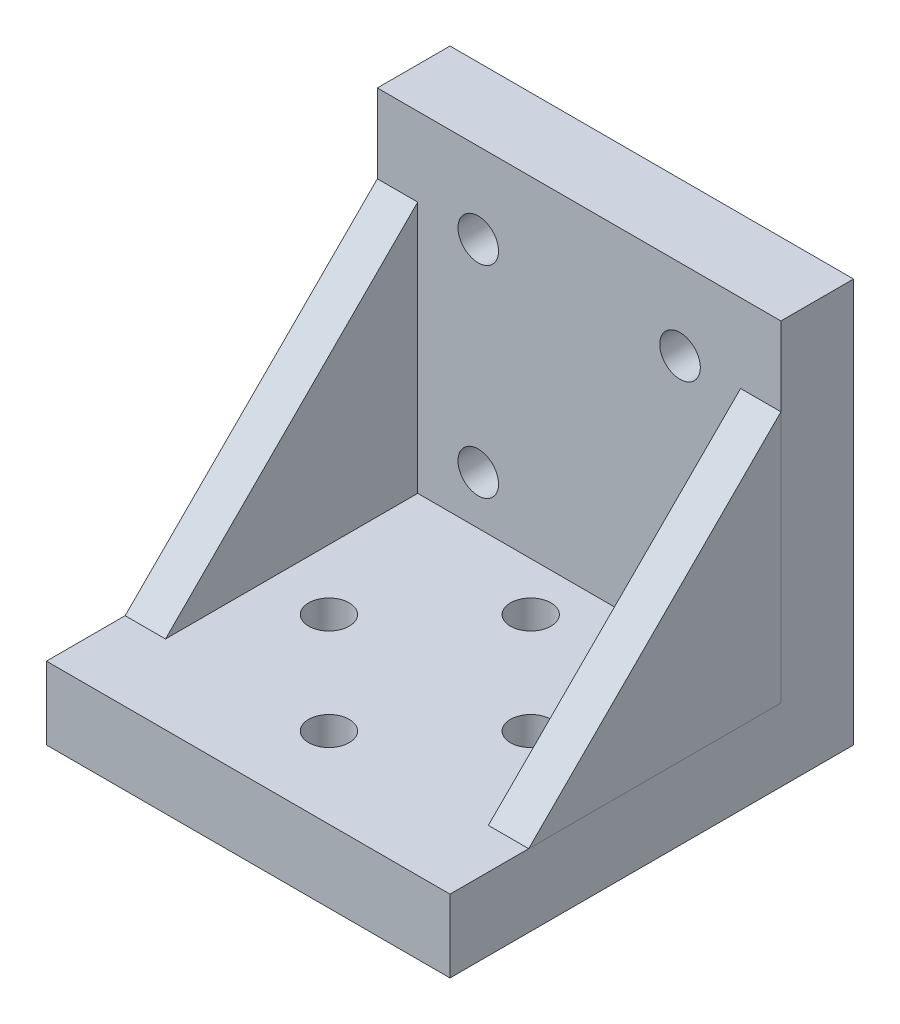
ISO-10303-21;
HEADER;
FILE_DESCRIPTION(('STEP AP214'),'2;1');
FILE_NAME('part.step','',(''),(''),'','','');
FILE_SCHEMA(('AUTOMOTIVE_DESIGN { 1 0 10303 214 1 1 1 1 }'));
ENDSEC;
DATA;
#1=APPLICATION_CONTEXT('core data for automotive mechanical design processes');
#2=APPLICATION_PROTOCOL_DEFINITION('international standard','automotive_design',2000,#1);
#3=PRODUCT_CONTEXT('',#1,'mechanical');
#4=PRODUCT('Part','Part','',(#3));
#5=PRODUCT_RELATED_PRODUCT_CATEGORY('part','',(#4));
#6=PRODUCT_DEFINITION_FORMATION('','',#4);
#7=PRODUCT_DEFINITION_CONTEXT('part definition',#1,'design');
#8=PRODUCT_DEFINITION('design','',#6,#7);
#9=PRODUCT_DEFINITION_SHAPE('','',#8);
#10=(LENGTH_UNIT() NAMED_UNIT(*) SI_UNIT(.MILLI.,.METRE.));
#11=(NAMED_UNIT(*) PLANE_ANGLE_UNIT() SI_UNIT($,.RADIAN.));
#12=(NAMED_UNIT(*) SI_UNIT($,.STERADIAN.) SOLID_ANGLE_UNIT());
#13=UNCERTAINTY_MEASURE_WITH_UNIT(LENGTH_MEASURE(1.E-05),#10,'distance_accuracy_value','');
#14=(GEOMETRIC_REPRESENTATION_CONTEXT(3) GLOBAL_UNCERTAINTY_ASSIGNED_CONTEXT((#13)) GLOBAL_UNIT_ASSIGNED_CONTEXT((#10,
#11,#12)) REPRESENTATION_CONTEXT('',''));
#15=CARTESIAN_POINT('',(0.,0.,0.));
#16=DIRECTION('',(0.,0.,1.));
#17=DIRECTION('',(1.,0.,0.));
#18=AXIS2_PLACEMENT_3D('',#15,#16,#17);
#19=CARTESIAN_POINT('',(45.72,9.14399999999999,40.894));
#20=DIRECTION('',(0.,-1.,0.));
#21=DIRECTION('',(0.,0.,-1.));
#22=AXIS2_PLACEMENT_3D('',#19,#20,#21);
#23=PLANE('',#22);
#24=DIRECTION('',(0.,0.,-1.));
#25=VECTOR('',#24,1.);
#26=CARTESIAN_POINT('',(50.8,9.14399999999999,40.894));
#27=LINE('',#26,#25);
#28=CARTESIAN_POINT('',(50.8,9.14399999999999,40.894));
#29=VERTEX_POINT('',#28);
#30=CARTESIAN_POINT('',(50.8,9.14399999999999,9.144));
#31=VERTEX_POINT('',#30);
#32=EDGE_CURVE('E98',#29,#31,#27,.T.);
#33=ORIENTED_EDGE('',*,*,#32,.F.);
#34=DIRECTION('',(1.,0.,0.));
#35=VECTOR('',#34,1.);
#36=CARTESIAN_POINT('',(45.72,9.14399999999999,40.894));
#37=LINE('',#36,#35);
#38=CARTESIAN_POINT('',(45.72,9.14399999999999,40.894));
#39=VERTEX_POINT('',#38);
#40=EDGE_CURVE('E12',#39,#29,#37,.T.);
#41=ORIENTED_EDGE('',*,*,#40,.F.);
#42=DIRECTION('',(0.,0.,-1.));
#43=VECTOR('',#42,1.);
#44=CARTESIAN_POINT('',(45.72,9.14399999999999,40.894));
#45=LINE('',#44,#43);
#46=CARTESIAN_POINT('',(45.72,9.14399999999999,9.144));
#47=VERTEX_POINT('',#46);
#48=EDGE_CURVE('E90',#39,#47,#45,.T.);
#49=ORIENTED_EDGE('',*,*,#48,.T.);
#50=DIRECTION('',(1.,0.,0.));
#51=VECTOR('',#50,1.);
#52=CARTESIAN_POINT('',(45.72,9.14399999999999,9.144));
#53=LINE('',#52,#51);
#54=EDGE_CURVE('E49',#47,#31,#53,.T.);
#55=ORIENTED_EDGE('',*,*,#54,.T.);
#56=EDGE_LOOP('',(#33,#41,#49,#55));
#57=FACE_BOUND('',#56,.T.);
#58=ADVANCED_FACE('F46',(#57),#23,.T.);
#59=CARTESIAN_POINT('',(45.72,40.894,9.144));
#60=DIRECTION('',(0.,0.707106781186548,0.707106781186548));
#61=DIRECTION('',(0.,-0.707106781186548,0.707106781186548));
#62=AXIS2_PLACEMENT_3D('',#59,#60,#61);
#63=PLANE('',#62);
#64=DIRECTION('',(0.,-0.707106781186548,0.707106781186548));
#65=VECTOR('',#64,1.);
#66=CARTESIAN_POINT('',(50.8,40.894,9.144));
#67=LINE('',#66,#65);
#68=CARTESIAN_POINT('',(50.8,40.894,9.144));
#69=VERTEX_POINT('',#68);
#70=EDGE_CURVE('E92',#69,#29,#67,.T.);
#71=ORIENTED_EDGE('',*,*,#70,.F.);
#72=DIRECTION('',(1.,0.,0.));
#73=VECTOR('',#72,1.);
#74=CARTESIAN_POINT('',(45.72,40.894,9.144));
#75=LINE('',#74,#73);
#76=CARTESIAN_POINT('',(45.72,40.894,9.144));
#77=VERTEX_POINT('',#76);
#78=EDGE_CURVE('E55',#77,#69,#75,.T.);
#79=ORIENTED_EDGE('',*,*,#78,.F.);
#80=DIRECTION('',(0.,-0.707106781186548,0.707106781186548));
#81=VECTOR('',#80,1.);
#82=CARTESIAN_POINT('',(45.72,40.894,9.144));
#83=LINE('',#82,#81);
#84=EDGE_CURVE('E87',#77,#39,#83,.T.);
#85=ORIENTED_EDGE('',*,*,#84,.T.);
#86=ORIENTED_EDGE('',*,*,#40,.T.);
#87=EDGE_LOOP('',(#71,#79,#85,#86));
#88=FACE_BOUND('',#87,.T.);
#89=ADVANCED_FACE('F102',(#88),#63,.T.);
#90=CARTESIAN_POINT('',(45.72,9.14399999999999,9.144));
#91=DIRECTION('',(0.,0.,-1.));
#92=DIRECTION('',(0.,1.,0.));
#93=AXIS2_PLACEMENT_3D('',#90,#91,#92);
#94=PLANE('',#93);
#95=DIRECTION('',(0.,1.,0.));
#96=VECTOR('',#95,1.);
#97=CARTESIAN_POINT('',(50.8,9.14399999999999,9.144));
#98=LINE('',#97,#96);
#99=EDGE_CURVE('E85',#31,#69,#98,.T.);
#100=ORIENTED_EDGE('',*,*,#99,.F.);
#101=ORIENTED_EDGE('',*,*,#54,.F.);
#102=DIRECTION('',(0.,1.,0.));
#103=VECTOR('',#102,1.);
#104=CARTESIAN_POINT('',(45.72,9.14399999999999,9.144));
#105=LINE('',#104,#103);
#106=EDGE_CURVE('E83',#47,#77,#105,.T.);
#107=ORIENTED_EDGE('',*,*,#106,.T.);
#108=ORIENTED_EDGE('',*,*,#78,.T.);
#109=EDGE_LOOP('',(#100,#101,#107,#108));
#110=FACE_BOUND('',#109,.T.);
#111=ADVANCED_FACE('F82',(#110),#94,.T.);
#112=CARTESIAN_POINT('',(45.72,9.14399999999999,9.144));
#113=DIRECTION('',(1.,0.,0.));
#114=DIRECTION('',(0.,0.,-1.));
#115=AXIS2_PLACEMENT_3D('',#112,#113,#114);
#116=PLANE('',#115);
#117=ORIENTED_EDGE('',*,*,#48,.F.);
#118=ORIENTED_EDGE('',*,*,#84,.F.);
#119=ORIENTED_EDGE('',*,*,#106,.F.);
#120=EDGE_LOOP('',(#117,#118,#119));
#121=FACE_BOUND('',#120,.T.);
#122=ADVANCED_FACE('F89',(#121),#116,.F.);
#123=CARTESIAN_POINT('',(50.8,9.14399999999999,9.144));
#124=DIRECTION('',(1.,0.,0.));
#125=DIRECTION('',(0.,0.,-1.));
#126=AXIS2_PLACEMENT_3D('',#123,#124,#125);
#127=PLANE('',#126);
#128=ORIENTED_EDGE('',*,*,#32,.T.);
#129=ORIENTED_EDGE('',*,*,#99,.T.);
#130=ORIENTED_EDGE('',*,*,#70,.T.);
#131=EDGE_LOOP('',(#128,#129,#130));
#132=FACE_BOUND('',#131,.T.);
#133=ADVANCED_FACE('F101',(#132),#127,.T.);
#134=CLOSED_SHELL('',(#58,#89,#111,#122,#133));
#135=MANIFOLD_SOLID_BREP('B2',#134);
#136=CARTESIAN_POINT('',(5.08,9.14399999999999,40.894));
#137=DIRECTION('',(0.,1.,0.));
#138=DIRECTION('',(0.,0.,1.));
#139=AXIS2_PLACEMENT_3D('',#136,#137,#138);
#140=PLANE('',#139);
#141=DIRECTION('',(0.,0.,-1.));
#142=VECTOR('',#141,1.);
#143=CARTESIAN_POINT('',(0.,9.14399999999999,40.894));
#144=LINE('',#143,#142);
#145=CARTESIAN_POINT('',(0.,9.14399999999999,40.894));
#146=VERTEX_POINT('',#145);
#147=CARTESIAN_POINT('',(0.,9.14399999999999,9.144));
#148=VERTEX_POINT('',#147);
#149=EDGE_CURVE('E200',#146,#148,#144,.T.);
#150=ORIENTED_EDGE('',*,*,#149,.T.);
#151=DIRECTION('',(-1.,0.,0.));
#152=VECTOR('',#151,1.);
#153=CARTESIAN_POINT('',(5.08,9.14399999999999,9.144));
#154=LINE('',#153,#152);
#155=CARTESIAN_POINT('',(5.08,9.14399999999999,9.144));
#156=VERTEX_POINT('',#155);
#157=EDGE_CURVE('E44',#156,#148,#154,.T.);
#158=ORIENTED_EDGE('',*,*,#157,.F.);
#159=DIRECTION('',(0.,0.,-1.));
#160=VECTOR('',#159,1.);
#161=CARTESIAN_POINT('',(5.08,9.14399999999999,40.894));
#162=LINE('',#161,#160);
#163=CARTESIAN_POINT('',(5.08,9.14399999999999,40.894));
#164=VERTEX_POINT('',#163);
#165=EDGE_CURVE('E193',#164,#156,#162,.T.);
#166=ORIENTED_EDGE('',*,*,#165,.F.);
#167=DIRECTION('',(-1.,0.,0.));
#168=VECTOR('',#167,1.);
#169=CARTESIAN_POINT('',(5.08,9.14399999999999,40.894));
#170=LINE('',#169,#168);
#171=EDGE_CURVE('E201',#164,#146,#170,.T.);
#172=ORIENTED_EDGE('',*,*,#171,.T.);
#173=EDGE_LOOP('',(#150,#158,#166,#172));
#174=FACE_BOUND('',#173,.T.);
#175=ADVANCED_FACE('F153',(#174),#140,.F.);
#176=CARTESIAN_POINT('',(5.08,9.14399999999999,9.144));
#177=DIRECTION('',(0.,0.,1.));
#178=DIRECTION('',(0.,-1.,0.));
#179=AXIS2_PLACEMENT_3D('',#176,#177,#178);
#180=PLANE('',#179);
#181=DIRECTION('',(0.,1.,0.));
#182=VECTOR('',#181,1.);
#183=CARTESIAN_POINT('',(0.,9.14399999999999,9.144));
#184=LINE('',#183,#182);
#185=CARTESIAN_POINT('',(0.,40.894,9.144));
#186=VERTEX_POINT('',#185);
#187=EDGE_CURVE('E181',#148,#186,#184,.T.);
#188=ORIENTED_EDGE('',*,*,#187,.T.);
#189=DIRECTION('',(-1.,0.,0.));
#190=VECTOR('',#189,1.);
#191=CARTESIAN_POINT('',(5.08,40.894,9.144));
#192=LINE('',#191,#190);
#193=CARTESIAN_POINT('',(5.08,40.894,9.144));
#194=VERTEX_POINT('',#193);
#195=EDGE_CURVE('E161',#194,#186,#192,.T.);
#196=ORIENTED_EDGE('',*,*,#195,.F.);
#197=DIRECTION('',(0.,1.,0.));
#198=VECTOR('',#197,1.);
#199=CARTESIAN_POINT('',(5.08,9.14399999999999,9.144));
#200=LINE('',#199,#198);
#201=EDGE_CURVE('E189',#156,#194,#200,.T.);
#202=ORIENTED_EDGE('',*,*,#201,.F.);
#203=ORIENTED_EDGE('',*,*,#157,.T.);
#204=EDGE_LOOP('',(#188,#196,#202,#203));
#205=FACE_BOUND('',#204,.T.);
#206=ADVANCED_FACE('F190',(#205),#180,.F.);
#207=CARTESIAN_POINT('',(5.08,40.894,9.144));
#208=DIRECTION('',(0.,-0.707106781186548,-0.707106781186548));
#209=DIRECTION('',(0.,0.707106781186548,-0.707106781186548));
#210=AXIS2_PLACEMENT_3D('',#207,#208,#209);
#211=PLANE('',#210);
#212=DIRECTION('',(0.,-0.707106781186548,0.707106781186548));
#213=VECTOR('',#212,1.);
#214=CARTESIAN_POINT('',(0.,40.894,9.144));
#215=LINE('',#214,#213);
#216=EDGE_CURVE('E186',#186,#146,#215,.T.);
#217=ORIENTED_EDGE('',*,*,#216,.T.);
#218=ORIENTED_EDGE('',*,*,#171,.F.);
#219=DIRECTION('',(0.,-0.707106781186548,0.707106781186548));
#220=VECTOR('',#219,1.);
#221=CARTESIAN_POINT('',(5.08,40.894,9.144));
#222=LINE('',#221,#220);
#223=EDGE_CURVE('E169',#194,#164,#222,.T.);
#224=ORIENTED_EDGE('',*,*,#223,.F.);
#225=ORIENTED_EDGE('',*,*,#195,.T.);
#226=EDGE_LOOP('',(#217,#218,#224,#225));
#227=FACE_BOUND('',#226,.T.);
#228=ADVANCED_FACE('F208',(#227),#211,.F.);
#229=CARTESIAN_POINT('',(5.08,9.14399999999999,9.144));
#230=DIRECTION('',(1.,0.,0.));
#231=DIRECTION('',(0.,0.,-1.));
#232=AXIS2_PLACEMENT_3D('',#229,#230,#231);
#233=PLANE('',#232);
#234=ORIENTED_EDGE('',*,*,#165,.T.);
#235=ORIENTED_EDGE('',*,*,#201,.T.);
#236=ORIENTED_EDGE('',*,*,#223,.T.);
#237=EDGE_LOOP('',(#234,#235,#236));
#238=FACE_BOUND('',#237,.T.);
#239=ADVANCED_FACE('F196',(#238),#233,.T.);
#240=CARTESIAN_POINT('',(0.,9.14399999999999,9.144));
#241=DIRECTION('',(1.,0.,0.));
#242=DIRECTION('',(0.,0.,-1.));
#243=AXIS2_PLACEMENT_3D('',#240,#241,#242);
#244=PLANE('',#243);
#245=ORIENTED_EDGE('',*,*,#149,.F.);
#246=ORIENTED_EDGE('',*,*,#216,.F.);
#247=ORIENTED_EDGE('',*,*,#187,.F.);
#248=EDGE_LOOP('',(#245,#246,#247));
#249=FACE_BOUND('',#248,.T.);
#250=ADVANCED_FACE('F209',(#249),#244,.F.);
#251=CLOSED_SHELL('',(#175,#206,#228,#239,#250));
#252=MANIFOLD_SOLID_BREP('B6',#251);
#253=CARTESIAN_POINT('',(50.8,50.8,0.));
#254=DIRECTION('',(0.,0.,1.));
#255=DIRECTION('',(0.,-1.,0.));
#256=AXIS2_PLACEMENT_3D('',#253,#254,#255);
#257=PLANE('',#256);
#258=CARTESIAN_POINT('',(12.7,40.64,0.));
#259=DIRECTION('',(0.,0.,-1.));
#260=DIRECTION('',(0.,1.,0.));
#261=AXIS2_PLACEMENT_3D('',#258,#259,#260);
#262=CIRCLE('',#261,2.55269999999999);
#263=CARTESIAN_POINT('',(12.7,43.1927,0.));
#264=VERTEX_POINT('',#263);
#265=EDGE_CURVE('E381',#264,#264,#262,.T.);
#266=ORIENTED_EDGE('',*,*,#265,.F.);
#267=EDGE_LOOP('',(#266));
#268=FACE_BOUND('',#267,.T.);
#269=CARTESIAN_POINT('',(12.7,15.24,0.));
#270=DIRECTION('',(0.,0.,-1.));
#271=DIRECTION('',(0.,1.,0.));
#272=AXIS2_PLACEMENT_3D('',#269,#270,#271);
#273=CIRCLE('',#272,2.55269999999999);
#274=CARTESIAN_POINT('',(12.7,17.7927,0.));
#275=VERTEX_POINT('',#274);
#276=EDGE_CURVE('E385',#275,#275,#273,.T.);
#277=ORIENTED_EDGE('',*,*,#276,.F.);
#278=EDGE_LOOP('',(#277));
#279=FACE_BOUND('',#278,.T.);
#280=CARTESIAN_POINT('',(38.1,15.24,0.));
#281=DIRECTION('',(0.,0.,-1.));
#282=DIRECTION('',(0.,1.,0.));
#283=AXIS2_PLACEMENT_3D('',#280,#281,#282);
#284=CIRCLE('',#283,2.55269999999999);
#285=CARTESIAN_POINT('',(38.1,17.7927,0.));
#286=VERTEX_POINT('',#285);
#287=EDGE_CURVE('E389',#286,#286,#284,.T.);
#288=ORIENTED_EDGE('',*,*,#287,.F.);
#289=EDGE_LOOP('',(#288));
#290=FACE_BOUND('',#289,.T.);
#291=CARTESIAN_POINT('',(38.1,40.64,0.));
#292=DIRECTION('',(0.,0.,-1.));
#293=DIRECTION('',(0.,1.,0.));
#294=AXIS2_PLACEMENT_3D('',#291,#292,#293);
#295=CIRCLE('',#294,2.55269999999999);
#296=CARTESIAN_POINT('',(38.1,43.1927,0.));
#297=VERTEX_POINT('',#296);
#298=EDGE_CURVE('E392',#297,#297,#295,.T.);
#299=ORIENTED_EDGE('',*,*,#298,.F.);
#300=EDGE_LOOP('',(#299));
#301=FACE_BOUND('',#300,.T.);
#302=DIRECTION('',(0.,1.,0.));
#303=VECTOR('',#302,1.);
#304=CARTESIAN_POINT('',(0.,50.8,0.));
#305=LINE('',#304,#303);
#306=CARTESIAN_POINT('',(0.,0.,0.));
#307=VERTEX_POINT('',#306);
#308=CARTESIAN_POINT('',(0.,50.8,0.));
#309=VERTEX_POINT('',#308);
#310=EDGE_CURVE('E335',#307,#309,#305,.T.);
#311=ORIENTED_EDGE('',*,*,#310,.T.);
#312=DIRECTION('',(-1.,0.,0.));
#313=VECTOR('',#312,1.);
#314=CARTESIAN_POINT('',(50.8,50.8,0.));
#315=LINE('',#314,#313);
#316=CARTESIAN_POINT('',(50.8,50.8,0.));
#317=VERTEX_POINT('',#316);
#318=EDGE_CURVE('E151',#317,#309,#315,.T.);
#319=ORIENTED_EDGE('',*,*,#318,.F.);
#320=DIRECTION('',(0.,1.,0.));
#321=VECTOR('',#320,1.);
#322=CARTESIAN_POINT('',(50.8,50.8,0.));
#323=LINE('',#322,#321);
#324=CARTESIAN_POINT('',(50.8,0.,0.));
#325=VERTEX_POINT('',#324);
#326=EDGE_CURVE('E346',#325,#317,#323,.T.);
#327=ORIENTED_EDGE('',*,*,#326,.F.);
#328=DIRECTION('',(-1.,0.,0.));
#329=VECTOR('',#328,1.);
#330=CARTESIAN_POINT('',(50.8,0.,0.));
#331=LINE('',#330,#329);
#332=EDGE_CURVE('E331',#325,#307,#331,.T.);
#333=ORIENTED_EDGE('',*,*,#332,.T.);
#334=EDGE_LOOP('',(#311,#319,#327,#333));
#335=FACE_BOUND('',#334,.T.);
#336=ADVANCED_FACE('F251',(#268,#279,#290,#301,#335),#257,.F.);
#337=CARTESIAN_POINT('',(50.8,50.8,9.144));
#338=DIRECTION('',(0.,-1.,0.));
#339=DIRECTION('',(0.,0.,-1.));
#340=AXIS2_PLACEMENT_3D('',#337,#338,#339);
#341=PLANE('',#340);
#342=DIRECTION('',(0.,0.,1.));
#343=VECTOR('',#342,1.);
#344=CARTESIAN_POINT('',(0.,50.8,9.144));
#345=LINE('',#344,#343);
#346=CARTESIAN_POINT('',(0.,50.8,9.144));
#347=VERTEX_POINT('',#346);
#348=EDGE_CURVE('E338',#309,#347,#345,.T.);
#349=ORIENTED_EDGE('',*,*,#348,.T.);
#350=DIRECTION('',(-1.,0.,0.));
#351=VECTOR('',#350,1.);
#352=CARTESIAN_POINT('',(50.8,50.8,9.144));
#353=LINE('',#352,#351);
#354=CARTESIAN_POINT('',(50.8,50.8,9.144));
#355=VERTEX_POINT('',#354);
#356=EDGE_CURVE('E259',#355,#347,#353,.T.);
#357=ORIENTED_EDGE('',*,*,#356,.F.);
#358=DIRECTION('',(0.,0.,1.));
#359=VECTOR('',#358,1.);
#360=CARTESIAN_POINT('',(50.8,50.8,9.144));
#361=LINE('',#360,#359);
#362=EDGE_CURVE('E304',#317,#355,#361,.T.);
#363=ORIENTED_EDGE('',*,*,#362,.F.);
#364=ORIENTED_EDGE('',*,*,#318,.T.);
#365=EDGE_LOOP('',(#349,#357,#363,#364));
#366=FACE_BOUND('',#365,.T.);
#367=ADVANCED_FACE('F373',(#366),#341,.F.);
#368=CARTESIAN_POINT('',(50.8,9.14399999999999,9.144));
#369=DIRECTION('',(0.,0.,-1.));
#370=DIRECTION('',(-1.,0.,0.));
#371=AXIS2_PLACEMENT_3D('',#368,#369,#370);
#372=PLANE('',#371);
#373=CARTESIAN_POINT('',(12.7,40.64,9.144));
#374=DIRECTION('',(0.,0.,-1.));
#375=DIRECTION('',(-1.,0.,0.));
#376=AXIS2_PLACEMENT_3D('',#373,#374,#375);
#377=CIRCLE('',#376,2.55269999999999);
#378=CARTESIAN_POINT('',(10.1473,40.64,9.144));
#379=VERTEX_POINT('',#378);
#380=EDGE_CURVE('E469',#379,#379,#377,.T.);
#381=ORIENTED_EDGE('',*,*,#380,.T.);
#382=EDGE_LOOP('',(#381));
#383=FACE_BOUND('',#382,.T.);
#384=CARTESIAN_POINT('',(12.7,15.24,9.144));
#385=DIRECTION('',(0.,0.,-1.));
#386=DIRECTION('',(-1.,0.,0.));
#387=AXIS2_PLACEMENT_3D('',#384,#385,#386);
#388=CIRCLE('',#387,2.55269999999999);
#389=CARTESIAN_POINT('',(10.1473,15.24,9.144));
#390=VERTEX_POINT('',#389);
#391=EDGE_CURVE('E472',#390,#390,#388,.T.);
#392=ORIENTED_EDGE('',*,*,#391,.T.);
#393=EDGE_LOOP('',(#392));
#394=FACE_BOUND('',#393,.T.);
#395=CARTESIAN_POINT('',(38.1,15.24,9.144));
#396=DIRECTION('',(0.,0.,-1.));
#397=DIRECTION('',(-1.,0.,0.));
#398=AXIS2_PLACEMENT_3D('',#395,#396,#397);
#399=CIRCLE('',#398,2.55269999999999);
#400=CARTESIAN_POINT('',(35.5473,15.24,9.144));
#401=VERTEX_POINT('',#400);
#402=EDGE_CURVE('E395',#401,#401,#399,.T.);
#403=ORIENTED_EDGE('',*,*,#402,.T.);
#404=EDGE_LOOP('',(#403));
#405=FACE_BOUND('',#404,.T.);
#406=CARTESIAN_POINT('',(38.1,40.64,9.144));
#407=DIRECTION('',(0.,0.,-1.));
#408=DIRECTION('',(-1.,0.,0.));
#409=AXIS2_PLACEMENT_3D('',#406,#407,#408);
#410=CIRCLE('',#409,2.55269999999999);
#411=CARTESIAN_POINT('',(35.5473,40.64,9.144));
#412=VERTEX_POINT('',#411);
#413=EDGE_CURVE('E394',#412,#412,#410,.T.);
#414=ORIENTED_EDGE('',*,*,#413,.T.);
#415=EDGE_LOOP('',(#414));
#416=FACE_BOUND('',#415,.T.);
#417=DIRECTION('',(0.,-1.,0.));
#418=VECTOR('',#417,1.);
#419=CARTESIAN_POINT('',(0.,9.14399999999999,9.144));
#420=LINE('',#419,#418);
#421=CARTESIAN_POINT('',(0.,9.14399999999999,9.144));
#422=VERTEX_POINT('',#421);
#423=EDGE_CURVE('E341',#347,#422,#420,.T.);
#424=ORIENTED_EDGE('',*,*,#423,.T.);
#425=DIRECTION('',(-1.,0.,0.));
#426=VECTOR('',#425,1.);
#427=CARTESIAN_POINT('',(50.8,9.14399999999999,9.144));
#428=LINE('',#427,#426);
#429=CARTESIAN_POINT('',(50.8,9.14399999999999,9.144));
#430=VERTEX_POINT('',#429);
#431=EDGE_CURVE('E326',#430,#422,#428,.T.);
#432=ORIENTED_EDGE('',*,*,#431,.F.);
#433=DIRECTION('',(0.,-1.,0.));
#434=VECTOR('',#433,1.);
#435=CARTESIAN_POINT('',(50.8,9.14399999999999,9.144));
#436=LINE('',#435,#434);
#437=EDGE_CURVE('E317',#355,#430,#436,.T.);
#438=ORIENTED_EDGE('',*,*,#437,.F.);
#439=ORIENTED_EDGE('',*,*,#356,.T.);
#440=EDGE_LOOP('',(#424,#432,#438,#439));
#441=FACE_BOUND('',#440,.T.);
#442=ADVANCED_FACE('F352',(#383,#394,#405,#416,#441),#372,.F.);
#443=CARTESIAN_POINT('',(50.8,9.14399999999999,50.8));
#444=DIRECTION('',(0.,-1.,0.));
#445=DIRECTION('',(0.,0.,-1.));
#446=AXIS2_PLACEMENT_3D('',#443,#444,#445);
#447=PLANE('',#446);
#448=CARTESIAN_POINT('',(25.4,9.14399999999999,40.64));
#449=DIRECTION('',(0.,-1.,0.));
#450=DIRECTION('',(0.,0.,-1.));
#451=AXIS2_PLACEMENT_3D('',#448,#449,#450);
#452=CIRCLE('',#451,2.55269999999999);
#453=CARTESIAN_POINT('',(25.4,9.14399999999999,38.0873));
#454=VERTEX_POINT('',#453);
#455=EDGE_CURVE('E406',#454,#454,#452,.T.);
#456=ORIENTED_EDGE('',*,*,#455,.T.);
#457=EDGE_LOOP('',(#456));
#458=FACE_BOUND('',#457,.T.);
#459=CARTESIAN_POINT('',(38.1,9.14399999999999,27.94));
#460=DIRECTION('',(0.,-1.,0.));
#461=DIRECTION('',(0.,0.,-1.));
#462=AXIS2_PLACEMENT_3D('',#459,#460,#461);
#463=CIRCLE('',#462,2.55269999999999);
#464=CARTESIAN_POINT('',(38.1,9.14399999999999,25.3873));
#465=VERTEX_POINT('',#464);
#466=EDGE_CURVE('E412',#465,#465,#463,.T.);
#467=ORIENTED_EDGE('',*,*,#466,.T.);
#468=EDGE_LOOP('',(#467));
#469=FACE_BOUND('',#468,.T.);
#470=CARTESIAN_POINT('',(12.7,9.14399999999999,27.94));
#471=DIRECTION('',(0.,-1.,0.));
#472=DIRECTION('',(0.,0.,-1.));
#473=AXIS2_PLACEMENT_3D('',#470,#471,#472);
#474=CIRCLE('',#473,2.55269999999999);
#475=CARTESIAN_POINT('',(12.7,9.14399999999999,25.3873));
#476=VERTEX_POINT('',#475);
#477=EDGE_CURVE('E418',#476,#476,#474,.T.);
#478=ORIENTED_EDGE('',*,*,#477,.T.);
#479=EDGE_LOOP('',(#478));
#480=FACE_BOUND('',#479,.T.);
#481=CARTESIAN_POINT('',(25.4,9.14399999999999,15.24));
#482=DIRECTION('',(0.,-1.,0.));
#483=DIRECTION('',(0.,0.,-1.));
#484=AXIS2_PLACEMENT_3D('',#481,#482,#483);
#485=CIRCLE('',#484,2.55269999999999);
#486=CARTESIAN_POINT('',(25.4,9.14399999999999,12.6873));
#487=VERTEX_POINT('',#486);
#488=EDGE_CURVE('E339',#487,#487,#485,.T.);
#489=ORIENTED_EDGE('',*,*,#488,.T.);
#490=EDGE_LOOP('',(#489));
#491=FACE_BOUND('',#490,.T.);
#492=DIRECTION('',(0.,0.,1.));
#493=VECTOR('',#492,1.);
#494=CARTESIAN_POINT('',(0.,9.14399999999999,50.8));
#495=LINE('',#494,#493);
#496=CARTESIAN_POINT('',(0.,9.14399999999999,50.8));
#497=VERTEX_POINT('',#496);
#498=EDGE_CURVE('E325',#422,#497,#495,.T.);
#499=ORIENTED_EDGE('',*,*,#498,.T.);
#500=DIRECTION('',(-1.,0.,0.));
#501=VECTOR('',#500,1.);
#502=CARTESIAN_POINT('',(50.8,9.14399999999999,50.8));
#503=LINE('',#502,#501);
#504=CARTESIAN_POINT('',(50.8,9.14399999999999,50.8));
#505=VERTEX_POINT('',#504);
#506=EDGE_CURVE('E322',#505,#497,#503,.T.);
#507=ORIENTED_EDGE('',*,*,#506,.F.);
#508=DIRECTION('',(0.,0.,1.));
#509=VECTOR('',#508,1.);
#510=CARTESIAN_POINT('',(50.8,9.14399999999999,50.8));
#511=LINE('',#510,#509);
#512=EDGE_CURVE('E311',#430,#505,#511,.T.);
#513=ORIENTED_EDGE('',*,*,#512,.F.);
#514=ORIENTED_EDGE('',*,*,#431,.T.);
#515=EDGE_LOOP('',(#499,#507,#513,#514));
#516=FACE_BOUND('',#515,.T.);
#517=ADVANCED_FACE('F323',(#458,#469,#480,#491,#516),#447,.F.);
#518=CARTESIAN_POINT('',(50.8,0.,50.8));
#519=DIRECTION('',(0.,0.,-1.));
#520=DIRECTION('',(-1.,0.,0.));
#521=AXIS2_PLACEMENT_3D('',#518,#519,#520);
#522=PLANE('',#521);
#523=DIRECTION('',(0.,-1.,0.));
#524=VECTOR('',#523,1.);
#525=CARTESIAN_POINT('',(0.,0.,50.8));
#526=LINE('',#525,#524);
#527=CARTESIAN_POINT('',(0.,0.,50.8));
#528=VERTEX_POINT('',#527);
#529=EDGE_CURVE('E290',#497,#528,#526,.T.);
#530=ORIENTED_EDGE('',*,*,#529,.T.);
#531=DIRECTION('',(-1.,0.,0.));
#532=VECTOR('',#531,1.);
#533=CARTESIAN_POINT('',(50.8,0.,50.8));
#534=LINE('',#533,#532);
#535=CARTESIAN_POINT('',(50.8,0.,50.8));
#536=VERTEX_POINT('',#535);
#537=EDGE_CURVE('E327',#536,#528,#534,.T.);
#538=ORIENTED_EDGE('',*,*,#537,.F.);
#539=DIRECTION('',(0.,-1.,0.));
#540=VECTOR('',#539,1.);
#541=CARTESIAN_POINT('',(50.8,0.,50.8));
#542=LINE('',#541,#540);
#543=EDGE_CURVE('E315',#505,#536,#542,.T.);
#544=ORIENTED_EDGE('',*,*,#543,.F.);
#545=ORIENTED_EDGE('',*,*,#506,.T.);
#546=EDGE_LOOP('',(#530,#538,#544,#545));
#547=FACE_BOUND('',#546,.T.);
#548=ADVANCED_FACE('F329',(#547),#522,.F.);
#549=CARTESIAN_POINT('',(50.8,0.,0.));
#550=DIRECTION('',(0.,1.,0.));
#551=DIRECTION('',(0.,0.,1.));
#552=AXIS2_PLACEMENT_3D('',#549,#550,#551);
#553=PLANE('',#552);
#554=CARTESIAN_POINT('',(25.4,0.,40.64));
#555=DIRECTION('',(0.,-1.,0.));
#556=DIRECTION('',(0.,0.,-1.));
#557=AXIS2_PLACEMENT_3D('',#554,#555,#556);
#558=CIRCLE('',#557,2.55269999999999);
#559=CARTESIAN_POINT('',(25.4,0.,38.0873));
#560=VERTEX_POINT('',#559);
#561=EDGE_CURVE('E398',#560,#560,#558,.T.);
#562=ORIENTED_EDGE('',*,*,#561,.F.);
#563=EDGE_LOOP('',(#562));
#564=FACE_BOUND('',#563,.T.);
#565=CARTESIAN_POINT('',(38.1,0.,27.94));
#566=DIRECTION('',(0.,-1.,0.));
#567=DIRECTION('',(0.,0.,-1.));
#568=AXIS2_PLACEMENT_3D('',#565,#566,#567);
#569=CIRCLE('',#568,2.55269999999999);
#570=CARTESIAN_POINT('',(38.1,0.,25.3873));
#571=VERTEX_POINT('',#570);
#572=EDGE_CURVE('E409',#571,#571,#569,.T.);
#573=ORIENTED_EDGE('',*,*,#572,.F.);
#574=EDGE_LOOP('',(#573));
#575=FACE_BOUND('',#574,.T.);
#576=CARTESIAN_POINT('',(12.7,0.,27.94));
#577=DIRECTION('',(0.,-1.,0.));
#578=DIRECTION('',(0.,0.,-1.));
#579=AXIS2_PLACEMENT_3D('',#576,#577,#578);
#580=CIRCLE('',#579,2.55269999999999);
#581=CARTESIAN_POINT('',(12.7,0.,25.3873));
#582=VERTEX_POINT('',#581);
#583=EDGE_CURVE('E415',#582,#582,#580,.T.);
#584=ORIENTED_EDGE('',*,*,#583,.F.);
#585=EDGE_LOOP('',(#584));
#586=FACE_BOUND('',#585,.T.);
#587=CARTESIAN_POINT('',(25.4,0.,15.24));
#588=DIRECTION('',(0.,-1.,0.));
#589=DIRECTION('',(0.,0.,-1.));
#590=AXIS2_PLACEMENT_3D('',#587,#588,#589);
#591=CIRCLE('',#590,2.55269999999999);
#592=CARTESIAN_POINT('',(25.4,0.,12.6873));
#593=VERTEX_POINT('',#592);
#594=EDGE_CURVE('E421',#593,#593,#591,.T.);
#595=ORIENTED_EDGE('',*,*,#594,.F.);
#596=EDGE_LOOP('',(#595));
#597=FACE_BOUND('',#596,.T.);
#598=DIRECTION('',(0.,0.,-1.));
#599=VECTOR('',#598,1.);
#600=CARTESIAN_POINT('',(0.,0.,0.));
#601=LINE('',#600,#599);
#602=EDGE_CURVE('E296',#528,#307,#601,.T.);
#603=ORIENTED_EDGE('',*,*,#602,.T.);
#604=ORIENTED_EDGE('',*,*,#332,.F.);
#605=DIRECTION('',(0.,0.,-1.));
#606=VECTOR('',#605,1.);
#607=CARTESIAN_POINT('',(50.8,0.,0.));
#608=LINE('',#607,#606);
#609=EDGE_CURVE('E267',#536,#325,#608,.T.);
#610=ORIENTED_EDGE('',*,*,#609,.F.);
#611=ORIENTED_EDGE('',*,*,#537,.T.);
#612=EDGE_LOOP('',(#603,#604,#610,#611));
#613=FACE_BOUND('',#612,.T.);
#614=ADVANCED_FACE('F359',(#564,#575,#586,#597,#613),#553,.F.);
#615=CARTESIAN_POINT('',(50.8,0.,0.));
#616=DIRECTION('',(-1.,0.,0.));
#617=DIRECTION('',(0.,0.,1.));
#618=AXIS2_PLACEMENT_3D('',#615,#616,#617);
#619=PLANE('',#618);
#620=ORIENTED_EDGE('',*,*,#326,.T.);
#621=ORIENTED_EDGE('',*,*,#362,.T.);
#622=ORIENTED_EDGE('',*,*,#437,.T.);
#623=ORIENTED_EDGE('',*,*,#512,.T.);
#624=ORIENTED_EDGE('',*,*,#543,.T.);
#625=ORIENTED_EDGE('',*,*,#609,.T.);
#626=EDGE_LOOP('',(#620,#621,#622,#623,#624,#625));
#627=FACE_BOUND('',#626,.T.);
#628=ADVANCED_FACE('F313',(#627),#619,.F.);
#629=CARTESIAN_POINT('',(0.,0.,0.));
#630=DIRECTION('',(-1.,0.,0.));
#631=DIRECTION('',(0.,0.,1.));
#632=AXIS2_PLACEMENT_3D('',#629,#630,#631);
#633=PLANE('',#632);
#634=ORIENTED_EDGE('',*,*,#310,.F.);
#635=ORIENTED_EDGE('',*,*,#602,.F.);
#636=ORIENTED_EDGE('',*,*,#529,.F.);
#637=ORIENTED_EDGE('',*,*,#498,.F.);
#638=ORIENTED_EDGE('',*,*,#423,.F.);
#639=ORIENTED_EDGE('',*,*,#348,.F.);
#640=EDGE_LOOP('',(#634,#635,#636,#637,#638,#639));
#641=FACE_BOUND('',#640,.T.);
#642=ADVANCED_FACE('F355',(#641),#633,.T.);
#643=CARTESIAN_POINT('',(25.4,0.,15.24));
#644=DIRECTION('',(0.,-1.,0.));
#645=DIRECTION('',(0.,0.,-1.));
#646=AXIS2_PLACEMENT_3D('',#643,#644,#645);
#647=CYLINDRICAL_SURFACE('',#646,2.55269999999999);
#648=ORIENTED_EDGE('',*,*,#594,.T.);
#649=EDGE_LOOP('',(#648));
#650=FACE_BOUND('',#649,.T.);
#651=ORIENTED_EDGE('',*,*,#488,.F.);
#652=EDGE_LOOP('',(#651));
#653=FACE_BOUND('',#652,.T.);
#654=ADVANCED_FACE('F430',(#650,#653),#647,.F.);
#655=CARTESIAN_POINT('',(12.7,0.,27.94));
#656=DIRECTION('',(0.,-1.,0.));
#657=DIRECTION('',(0.,0.,-1.));
#658=AXIS2_PLACEMENT_3D('',#655,#656,#657);
#659=CYLINDRICAL_SURFACE('',#658,2.55269999999999);
#660=ORIENTED_EDGE('',*,*,#583,.T.);
#661=EDGE_LOOP('',(#660));
#662=FACE_BOUND('',#661,.T.);
#663=ORIENTED_EDGE('',*,*,#477,.F.);
#664=EDGE_LOOP('',(#663));
#665=FACE_BOUND('',#664,.T.);
#666=ADVANCED_FACE('F432',(#662,#665),#659,.F.);
#667=CARTESIAN_POINT('',(38.1,0.,27.94));
#668=DIRECTION('',(0.,-1.,0.));
#669=DIRECTION('',(0.,0.,-1.));
#670=AXIS2_PLACEMENT_3D('',#667,#668,#669);
#671=CYLINDRICAL_SURFACE('',#670,2.55269999999999);
#672=ORIENTED_EDGE('',*,*,#572,.T.);
#673=EDGE_LOOP('',(#672));
#674=FACE_BOUND('',#673,.T.);
#675=ORIENTED_EDGE('',*,*,#466,.F.);
#676=EDGE_LOOP('',(#675));
#677=FACE_BOUND('',#676,.T.);
#678=ADVANCED_FACE('F439',(#674,#677),#671,.F.);
#679=CARTESIAN_POINT('',(25.4,0.,40.64));
#680=DIRECTION('',(0.,-1.,0.));
#681=DIRECTION('',(0.,0.,-1.));
#682=AXIS2_PLACEMENT_3D('',#679,#680,#681);
#683=CYLINDRICAL_SURFACE('',#682,2.55269999999999);
#684=ORIENTED_EDGE('',*,*,#561,.T.);
#685=EDGE_LOOP('',(#684));
#686=FACE_BOUND('',#685,.T.);
#687=ORIENTED_EDGE('',*,*,#455,.F.);
#688=EDGE_LOOP('',(#687));
#689=FACE_BOUND('',#688,.T.);
#690=ADVANCED_FACE('F445',(#686,#689),#683,.F.);
#691=CARTESIAN_POINT('',(38.1,40.64,0.));
#692=DIRECTION('',(0.,0.,-1.));
#693=DIRECTION('',(0.,1.,0.));
#694=AXIS2_PLACEMENT_3D('',#691,#692,#693);
#695=CYLINDRICAL_SURFACE('',#694,2.55269999999999);
#696=ORIENTED_EDGE('',*,*,#298,.T.);
#697=EDGE_LOOP('',(#696));
#698=FACE_BOUND('',#697,.T.);
#699=ORIENTED_EDGE('',*,*,#413,.F.);
#700=EDGE_LOOP('',(#699));
#701=FACE_BOUND('',#700,.T.);
#702=ADVANCED_FACE('F449',(#698,#701),#695,.F.);
#703=CARTESIAN_POINT('',(38.1,15.24,0.));
#704=DIRECTION('',(0.,0.,-1.));
#705=DIRECTION('',(0.,1.,0.));
#706=AXIS2_PLACEMENT_3D('',#703,#704,#705);
#707=CYLINDRICAL_SURFACE('',#706,2.55269999999999);
#708=ORIENTED_EDGE('',*,*,#287,.T.);
#709=EDGE_LOOP('',(#708));
#710=FACE_BOUND('',#709,.T.);
#711=ORIENTED_EDGE('',*,*,#402,.F.);
#712=EDGE_LOOP('',(#711));
#713=FACE_BOUND('',#712,.T.);
#714=ADVANCED_FACE('F453',(#710,#713),#707,.F.);
#715=CARTESIAN_POINT('',(12.7,15.24,0.));
#716=DIRECTION('',(0.,0.,-1.));
#717=DIRECTION('',(0.,1.,0.));
#718=AXIS2_PLACEMENT_3D('',#715,#716,#717);
#719=CYLINDRICAL_SURFACE('',#718,2.55269999999999);
#720=ORIENTED_EDGE('',*,*,#276,.T.);
#721=EDGE_LOOP('',(#720));
#722=FACE_BOUND('',#721,.T.);
#723=ORIENTED_EDGE('',*,*,#391,.F.);
#724=EDGE_LOOP('',(#723));
#725=FACE_BOUND('',#724,.T.);
#726=ADVANCED_FACE('F456',(#722,#725),#719,.F.);
#727=CARTESIAN_POINT('',(12.7,40.64,0.));
#728=DIRECTION('',(0.,0.,-1.));
#729=DIRECTION('',(0.,1.,0.));
#730=AXIS2_PLACEMENT_3D('',#727,#728,#729);
#731=CYLINDRICAL_SURFACE('',#730,2.55269999999999);
#732=ORIENTED_EDGE('',*,*,#265,.T.);
#733=EDGE_LOOP('',(#732));
#734=FACE_BOUND('',#733,.T.);
#735=ORIENTED_EDGE('',*,*,#380,.F.);
#736=EDGE_LOOP('',(#735));
#737=FACE_BOUND('',#736,.T.);
#738=ADVANCED_FACE('F460',(#734,#737),#731,.F.);
#739=CLOSED_SHELL('',(#336,#367,#442,#517,#548,#614,#628,#642,#654,#666,#678,#690,#702,#714,
#726,#738));
#740=MANIFOLD_SOLID_BREP('B38',#739);
#741=ADVANCED_BREP_SHAPE_REPRESENTATION('',(#18,#135,#252,#740),#14);
#742=SHAPE_DEFINITION_REPRESENTATION(#9,#741);
ENDSEC;
END-ISO-10303-21;
